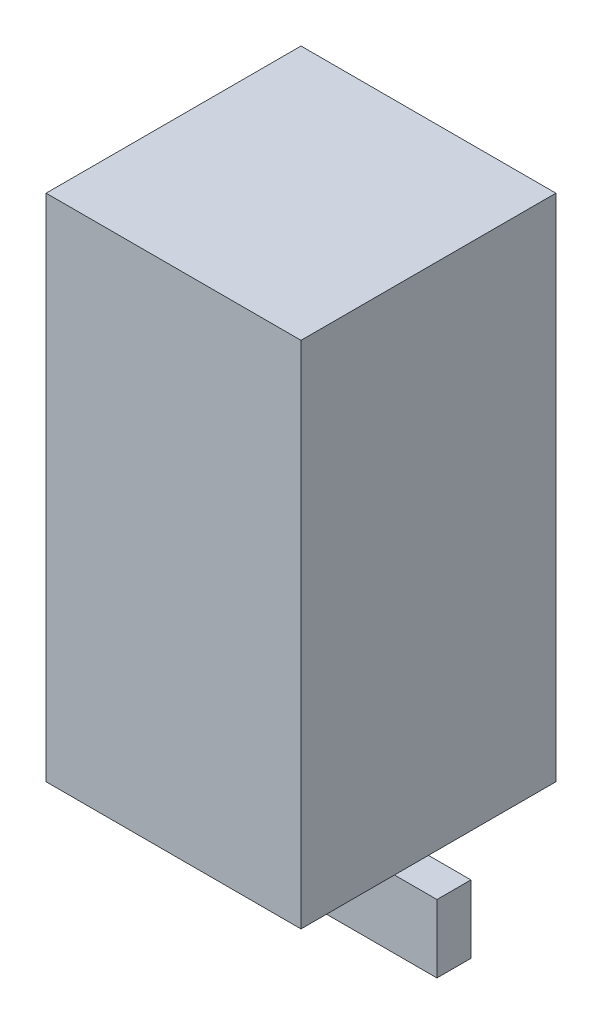
ISO-10303-21;
HEADER;
FILE_DESCRIPTION(('STEP AP214'),'2;1');
FILE_NAME('part.step','',(''),(''),'','','');
FILE_SCHEMA(('AUTOMOTIVE_DESIGN { 1 0 10303 214 1 1 1 1 }'));
ENDSEC;
DATA;
#1=APPLICATION_CONTEXT('core data for automotive mechanical design processes');
#2=APPLICATION_PROTOCOL_DEFINITION('international standard','automotive_design',2000,#1);
#3=PRODUCT_CONTEXT('',#1,'mechanical');
#4=PRODUCT('Part','Part','',(#3));
#5=PRODUCT_RELATED_PRODUCT_CATEGORY('part','',(#4));
#6=PRODUCT_DEFINITION_FORMATION('','',#4);
#7=PRODUCT_DEFINITION_CONTEXT('part definition',#1,'design');
#8=PRODUCT_DEFINITION('design','',#6,#7);
#9=PRODUCT_DEFINITION_SHAPE('','',#8);
#10=(LENGTH_UNIT() NAMED_UNIT(*) SI_UNIT(.MILLI.,.METRE.));
#11=(NAMED_UNIT(*) PLANE_ANGLE_UNIT() SI_UNIT($,.RADIAN.));
#12=(NAMED_UNIT(*) SI_UNIT($,.STERADIAN.) SOLID_ANGLE_UNIT());
#13=UNCERTAINTY_MEASURE_WITH_UNIT(LENGTH_MEASURE(1.E-05),#10,'distance_accuracy_value','');
#14=(GEOMETRIC_REPRESENTATION_CONTEXT(3) GLOBAL_UNCERTAINTY_ASSIGNED_CONTEXT((#13)) GLOBAL_UNIT_ASSIGNED_CONTEXT((#10,
#11,#12)) REPRESENTATION_CONTEXT('',''));
#15=CARTESIAN_POINT('',(0.,0.,0.));
#16=DIRECTION('',(0.,0.,1.));
#17=DIRECTION('',(1.,0.,0.));
#18=AXIS2_PLACEMENT_3D('',#15,#16,#17);
#19=CARTESIAN_POINT('',(0.,-2.,0.));
#20=DIRECTION('',(0.,-1.,0.));
#21=DIRECTION('',(0.,0.,-1.));
#22=AXIS2_PLACEMENT_3D('',#19,#20,#21);
#23=PLANE('',#22);
#24=CARTESIAN_POINT('',(0.,-2.,0.));
#25=DIRECTION('',(0.,-1.,0.));
#26=DIRECTION('',(0.,0.,-1.));
#27=AXIS2_PLACEMENT_3D('',#24,#25,#26);
#28=CIRCLE('',#27,5.);
#29=CARTESIAN_POINT('',(-4.58257569495584,-2.,-2.));
#30=VERTEX_POINT('',#29);
#31=CARTESIAN_POINT('',(4.58257569495584,-2.,-2.));
#32=VERTEX_POINT('',#31);
#33=EDGE_CURVE('E183',#30,#32,#28,.T.);
#34=ORIENTED_EDGE('',*,*,#33,.T.);
#35=DIRECTION('',(-1.,0.,0.));
#36=VECTOR('',#35,1.);
#37=CARTESIAN_POINT('',(-5.,-2.,-2.));
#38=LINE('',#37,#36);
#39=EDGE_CURVE('E49',#32,#30,#38,.T.);
#40=ORIENTED_EDGE('',*,*,#39,.T.);
#41=EDGE_LOOP('',(#34,#40));
#42=FACE_BOUND('',#41,.T.);
#43=ADVANCED_FACE('F39',(#42),#23,.T.);
#44=CARTESIAN_POINT('',(15.,60.,15.));
#45=DIRECTION('',(-1.,0.,0.));
#46=DIRECTION('',(0.,0.,1.));
#47=AXIS2_PLACEMENT_3D('',#44,#45,#46);
#48=PLANE('',#47);
#49=DIRECTION('',(0.,0.,-1.));
#50=VECTOR('',#49,1.);
#51=CARTESIAN_POINT('',(15.,0.,15.));
#52=LINE('',#51,#50);
#53=CARTESIAN_POINT('',(15.,0.,15.));
#54=VERTEX_POINT('',#53);
#55=CARTESIAN_POINT('',(15.,0.,-15.));
#56=VERTEX_POINT('',#55);
#57=EDGE_CURVE('E193',#54,#56,#52,.T.);
#58=ORIENTED_EDGE('',*,*,#57,.T.);
#59=DIRECTION('',(0.,-1.,0.));
#60=VECTOR('',#59,1.);
#61=CARTESIAN_POINT('',(15.,60.,-15.));
#62=LINE('',#61,#60);
#63=CARTESIAN_POINT('',(15.,60.,-15.));
#64=VERTEX_POINT('',#63);
#65=EDGE_CURVE('E43',#64,#56,#62,.T.);
#66=ORIENTED_EDGE('',*,*,#65,.F.);
#67=DIRECTION('',(0.,0.,-1.));
#68=VECTOR('',#67,1.);
#69=CARTESIAN_POINT('',(15.,60.,15.));
#70=LINE('',#69,#68);
#71=CARTESIAN_POINT('',(15.,60.,15.));
#72=VERTEX_POINT('',#71);
#73=EDGE_CURVE('E199',#72,#64,#70,.T.);
#74=ORIENTED_EDGE('',*,*,#73,.F.);
#75=DIRECTION('',(0.,-1.,0.));
#76=VECTOR('',#75,1.);
#77=CARTESIAN_POINT('',(15.,60.,15.));
#78=LINE('',#77,#76);
#79=EDGE_CURVE('E209',#72,#54,#78,.T.);
#80=ORIENTED_EDGE('',*,*,#79,.T.);
#81=EDGE_LOOP('',(#58,#66,#74,#80));
#82=FACE_BOUND('',#81,.T.);
#83=ADVANCED_FACE('F41',(#82),#48,.F.);
#84=CARTESIAN_POINT('',(-15.,60.,-15.));
#85=DIRECTION('',(0.,0.,1.));
#86=DIRECTION('',(1.,0.,0.));
#87=AXIS2_PLACEMENT_3D('',#84,#85,#86);
#88=PLANE('',#87);
#89=DIRECTION('',(-1.,0.,0.));
#90=VECTOR('',#89,1.);
#91=CARTESIAN_POINT('',(-15.,0.,-15.));
#92=LINE('',#91,#90);
#93=CARTESIAN_POINT('',(-15.,0.,-15.));
#94=VERTEX_POINT('',#93);
#95=EDGE_CURVE('E213',#56,#94,#92,.T.);
#96=ORIENTED_EDGE('',*,*,#95,.T.);
#97=DIRECTION('',(0.,-1.,0.));
#98=VECTOR('',#97,1.);
#99=CARTESIAN_POINT('',(-15.,60.,-15.));
#100=LINE('',#99,#98);
#101=CARTESIAN_POINT('',(-15.,60.,-15.));
#102=VERTEX_POINT('',#101);
#103=EDGE_CURVE('E225',#102,#94,#100,.T.);
#104=ORIENTED_EDGE('',*,*,#103,.F.);
#105=DIRECTION('',(-1.,0.,0.));
#106=VECTOR('',#105,1.);
#107=CARTESIAN_POINT('',(-15.,60.,-15.));
#108=LINE('',#107,#106);
#109=EDGE_CURVE('E97',#64,#102,#108,.T.);
#110=ORIENTED_EDGE('',*,*,#109,.F.);
#111=ORIENTED_EDGE('',*,*,#65,.T.);
#112=EDGE_LOOP('',(#96,#104,#110,#111));
#113=FACE_BOUND('',#112,.T.);
#114=ADVANCED_FACE('F233',(#113),#88,.F.);
#115=CARTESIAN_POINT('',(-15.,60.,15.));
#116=DIRECTION('',(1.,0.,0.));
#117=DIRECTION('',(0.,0.,-1.));
#118=AXIS2_PLACEMENT_3D('',#115,#116,#117);
#119=PLANE('',#118);
#120=DIRECTION('',(0.,0.,1.));
#121=VECTOR('',#120,1.);
#122=CARTESIAN_POINT('',(-15.,0.,15.));
#123=LINE('',#122,#121);
#124=CARTESIAN_POINT('',(-15.,0.,15.));
#125=VERTEX_POINT('',#124);
#126=EDGE_CURVE('E216',#94,#125,#123,.T.);
#127=ORIENTED_EDGE('',*,*,#126,.T.);
#128=DIRECTION('',(0.,-1.,0.));
#129=VECTOR('',#128,1.);
#130=CARTESIAN_POINT('',(-15.,60.,15.));
#131=LINE('',#130,#129);
#132=CARTESIAN_POINT('',(-15.,60.,15.));
#133=VERTEX_POINT('',#132);
#134=EDGE_CURVE('E223',#133,#125,#131,.T.);
#135=ORIENTED_EDGE('',*,*,#134,.F.);
#136=DIRECTION('',(0.,0.,1.));
#137=VECTOR('',#136,1.);
#138=CARTESIAN_POINT('',(-15.,60.,15.));
#139=LINE('',#138,#137);
#140=EDGE_CURVE('E204',#102,#133,#139,.T.);
#141=ORIENTED_EDGE('',*,*,#140,.F.);
#142=ORIENTED_EDGE('',*,*,#103,.T.);
#143=EDGE_LOOP('',(#127,#135,#141,#142));
#144=FACE_BOUND('',#143,.T.);
#145=ADVANCED_FACE('F240',(#144),#119,.F.);
#146=CARTESIAN_POINT('',(-15.,60.,15.));
#147=DIRECTION('',(0.,0.,-1.));
#148=DIRECTION('',(-1.,0.,0.));
#149=AXIS2_PLACEMENT_3D('',#146,#147,#148);
#150=PLANE('',#149);
#151=DIRECTION('',(1.,0.,0.));
#152=VECTOR('',#151,1.);
#153=CARTESIAN_POINT('',(-15.,0.,15.));
#154=LINE('',#153,#152);
#155=EDGE_CURVE('E89',#125,#54,#154,.T.);
#156=ORIENTED_EDGE('',*,*,#155,.T.);
#157=ORIENTED_EDGE('',*,*,#79,.F.);
#158=DIRECTION('',(1.,0.,0.));
#159=VECTOR('',#158,1.);
#160=CARTESIAN_POINT('',(-15.,60.,15.));
#161=LINE('',#160,#159);
#162=EDGE_CURVE('E68',#133,#72,#161,.T.);
#163=ORIENTED_EDGE('',*,*,#162,.F.);
#164=ORIENTED_EDGE('',*,*,#134,.T.);
#165=EDGE_LOOP('',(#156,#157,#163,#164));
#166=FACE_BOUND('',#165,.T.);
#167=ADVANCED_FACE('F241',(#166),#150,.F.);
#168=CARTESIAN_POINT('',(0.,60.,0.));
#169=DIRECTION('',(0.,-1.,0.));
#170=DIRECTION('',(0.,0.,-1.));
#171=AXIS2_PLACEMENT_3D('',#168,#169,#170);
#172=PLANE('',#171);
#173=ORIENTED_EDGE('',*,*,#73,.T.);
#174=ORIENTED_EDGE('',*,*,#109,.T.);
#175=ORIENTED_EDGE('',*,*,#140,.T.);
#176=ORIENTED_EDGE('',*,*,#162,.T.);
#177=EDGE_LOOP('',(#173,#174,#175,#176));
#178=FACE_BOUND('',#177,.T.);
#179=ADVANCED_FACE('F242',(#178),#172,.F.);
#180=CARTESIAN_POINT('',(0.,0.,0.));
#181=DIRECTION('',(0.,-1.,0.));
#182=DIRECTION('',(0.,0.,-1.));
#183=AXIS2_PLACEMENT_3D('',#180,#181,#182);
#184=PLANE('',#183);
#185=CARTESIAN_POINT('',(0.,0.,0.));
#186=DIRECTION('',(0.,-1.,0.));
#187=DIRECTION('',(0.,0.,-1.));
#188=AXIS2_PLACEMENT_3D('',#185,#186,#187);
#189=CIRCLE('',#188,5.);
#190=CARTESIAN_POINT('',(0.,0.,-5.));
#191=VERTEX_POINT('',#190);
#192=EDGE_CURVE('E195',#191,#191,#189,.T.);
#193=ORIENTED_EDGE('',*,*,#192,.F.);
#194=EDGE_LOOP('',(#193));
#195=FACE_BOUND('',#194,.T.);
#196=ORIENTED_EDGE('',*,*,#57,.F.);
#197=ORIENTED_EDGE('',*,*,#155,.F.);
#198=ORIENTED_EDGE('',*,*,#126,.F.);
#199=ORIENTED_EDGE('',*,*,#95,.F.);
#200=EDGE_LOOP('',(#196,#197,#198,#199));
#201=FACE_BOUND('',#200,.T.);
#202=ADVANCED_FACE('F238',(#195,#201),#184,.T.);
#203=CARTESIAN_POINT('',(0.,-2.,0.));
#204=DIRECTION('',(0.,1.,0.));
#205=DIRECTION('',(0.,0.,1.));
#206=AXIS2_PLACEMENT_3D('',#203,#204,#205);
#207=CYLINDRICAL_SURFACE('',#206,5.);
#208=CARTESIAN_POINT('',(4.58257569495584,-2.,2.));
#209=VERTEX_POINT('',#208);
#210=EDGE_CURVE('E190',#32,#209,#28,.T.);
#211=ORIENTED_EDGE('',*,*,#210,.F.);
#212=ORIENTED_EDGE('',*,*,#33,.F.);
#213=CARTESIAN_POINT('',(-5.,-2.,0.));
#214=VERTEX_POINT('',#213);
#215=EDGE_CURVE('E286',#214,#30,#28,.T.);
#216=ORIENTED_EDGE('',*,*,#215,.F.);
#217=CARTESIAN_POINT('',(-4.58257569495584,-2.,2.));
#218=VERTEX_POINT('',#217);
#219=EDGE_CURVE('E283',#218,#214,#28,.T.);
#220=ORIENTED_EDGE('',*,*,#219,.F.);
#221=EDGE_CURVE('E194',#209,#218,#28,.T.);
#222=ORIENTED_EDGE('',*,*,#221,.F.);
#223=EDGE_LOOP('',(#211,#212,#216,#220,#222));
#224=FACE_BOUND('',#223,.T.);
#225=ORIENTED_EDGE('',*,*,#192,.T.);
#226=EDGE_LOOP('',(#225));
#227=FACE_BOUND('',#226,.T.);
#228=ADVANCED_FACE('F249',(#224,#227),#207,.T.);
#229=DIRECTION('',(-1.,0.,0.));
#230=VECTOR('',#229,1.);
#231=CARTESIAN_POINT('',(-5.,-2.,2.));
#232=LINE('',#231,#230);
#233=EDGE_CURVE('E11',#209,#218,#232,.T.);
#234=ORIENTED_EDGE('',*,*,#233,.F.);
#235=ORIENTED_EDGE('',*,*,#221,.T.);
#236=EDGE_LOOP('',(#234,#235));
#237=FACE_BOUND('',#236,.T.);
#238=ADVANCED_FACE('F257',(#237),#23,.T.);
#239=CARTESIAN_POINT('',(-5.,-2.,-2.));
#240=DIRECTION('',(0.,1.,0.));
#241=DIRECTION('',(0.,0.,1.));
#242=AXIS2_PLACEMENT_3D('',#239,#240,#241);
#243=PLANE('',#242);
#244=CARTESIAN_POINT('',(18.,-2.,-2.));
#245=VERTEX_POINT('',#244);
#246=EDGE_CURVE('E147',#245,#32,#38,.T.);
#247=ORIENTED_EDGE('',*,*,#246,.T.);
#248=ORIENTED_EDGE('',*,*,#210,.T.);
#249=CARTESIAN_POINT('',(18.,-2.,2.));
#250=VERTEX_POINT('',#249);
#251=EDGE_CURVE('E51',#250,#209,#232,.T.);
#252=ORIENTED_EDGE('',*,*,#251,.F.);
#253=DIRECTION('',(0.,0.,1.));
#254=VECTOR('',#253,1.);
#255=CARTESIAN_POINT('',(18.,-2.,-2.));
#256=LINE('',#255,#254);
#257=EDGE_CURVE('E185',#245,#250,#256,.T.);
#258=ORIENTED_EDGE('',*,*,#257,.F.);
#259=EDGE_LOOP('',(#247,#248,#252,#258));
#260=FACE_BOUND('',#259,.T.);
#261=ADVANCED_FACE('F264',(#260),#243,.T.);
#262=CARTESIAN_POINT('',(-5.,-2.,2.));
#263=VERTEX_POINT('',#262);
#264=EDGE_CURVE('E52',#218,#263,#232,.T.);
#265=ORIENTED_EDGE('',*,*,#264,.F.);
#266=ORIENTED_EDGE('',*,*,#219,.T.);
#267=DIRECTION('',(0.,0.,1.));
#268=VECTOR('',#267,1.);
#269=CARTESIAN_POINT('',(-5.,-2.,-2.));
#270=LINE('',#269,#268);
#271=EDGE_CURVE('E184',#214,#263,#270,.T.);
#272=ORIENTED_EDGE('',*,*,#271,.T.);
#273=EDGE_LOOP('',(#265,#266,#272));
#274=FACE_BOUND('',#273,.T.);
#275=ADVANCED_FACE('F270',(#274),#243,.T.);
#276=CARTESIAN_POINT('',(0.601660305677737,-10.,-2.));
#277=DIRECTION('',(-0.819152044288989,-0.57357643635105,0.));
#278=DIRECTION('',(0.57357643635105,-0.819152044288989,0.));
#279=AXIS2_PLACEMENT_3D('',#276,#277,#278);
#280=PLANE('',#279);
#281=DIRECTION('',(0.,0.,1.));
#282=VECTOR('',#281,1.);
#283=CARTESIAN_POINT('',(0.601660305677737,-10.,-2.));
#284=LINE('',#283,#282);
#285=CARTESIAN_POINT('',(0.601660305677737,-10.,-2.));
#286=VERTEX_POINT('',#285);
#287=CARTESIAN_POINT('',(0.601660305677737,-10.,2.));
#288=VERTEX_POINT('',#287);
#289=EDGE_CURVE('E134',#286,#288,#284,.T.);
#290=ORIENTED_EDGE('',*,*,#289,.T.);
#291=DIRECTION('',(0.57357643635105,-0.819152044288989,0.));
#292=VECTOR('',#291,1.);
#293=CARTESIAN_POINT('',(0.601660305677737,-10.,2.));
#294=LINE('',#293,#292);
#295=EDGE_CURVE('E139',#263,#288,#294,.T.);
#296=ORIENTED_EDGE('',*,*,#295,.F.);
#297=ORIENTED_EDGE('',*,*,#271,.F.);
#298=CARTESIAN_POINT('',(-5.,-2.,-2.));
#299=VERTEX_POINT('',#298);
#300=EDGE_CURVE('E179',#299,#214,#270,.T.);
#301=ORIENTED_EDGE('',*,*,#300,.F.);
#302=DIRECTION('',(0.57357643635105,-0.819152044288989,0.));
#303=VECTOR('',#302,1.);
#304=CARTESIAN_POINT('',(0.601660305677737,-10.,-2.));
#305=LINE('',#304,#303);
#306=EDGE_CURVE('E141',#299,#286,#305,.T.);
#307=ORIENTED_EDGE('',*,*,#306,.T.);
#308=EDGE_LOOP('',(#290,#296,#297,#301,#307));
#309=FACE_BOUND('',#308,.T.);
#310=ADVANCED_FACE('F136',(#309),#280,.T.);
#311=ORIENTED_EDGE('',*,*,#300,.T.);
#312=ORIENTED_EDGE('',*,*,#215,.T.);
#313=EDGE_CURVE('E59',#30,#299,#38,.T.);
#314=ORIENTED_EDGE('',*,*,#313,.T.);
#315=EDGE_LOOP('',(#311,#312,#314));
#316=FACE_BOUND('',#315,.T.);
#317=ADVANCED_FACE('F273',(#316),#243,.T.);
#318=CARTESIAN_POINT('',(18.,-2.,-2.));
#319=DIRECTION('',(1.,0.,0.));
#320=DIRECTION('',(0.,0.,-1.));
#321=AXIS2_PLACEMENT_3D('',#318,#319,#320);
#322=PLANE('',#321);
#323=ORIENTED_EDGE('',*,*,#257,.T.);
#324=DIRECTION('',(0.,1.,0.));
#325=VECTOR('',#324,1.);
#326=CARTESIAN_POINT('',(18.,-2.,2.));
#327=LINE('',#326,#325);
#328=CARTESIAN_POINT('',(18.,-10.,2.));
#329=VERTEX_POINT('',#328);
#330=EDGE_CURVE('E156',#329,#250,#327,.T.);
#331=ORIENTED_EDGE('',*,*,#330,.F.);
#332=DIRECTION('',(0.,0.,1.));
#333=VECTOR('',#332,1.);
#334=CARTESIAN_POINT('',(18.,-10.,-2.));
#335=LINE('',#334,#333);
#336=CARTESIAN_POINT('',(18.,-10.,-2.));
#337=VERTEX_POINT('',#336);
#338=EDGE_CURVE('E146',#337,#329,#335,.T.);
#339=ORIENTED_EDGE('',*,*,#338,.F.);
#340=DIRECTION('',(0.,1.,0.));
#341=VECTOR('',#340,1.);
#342=CARTESIAN_POINT('',(18.,-2.,-2.));
#343=LINE('',#342,#341);
#344=EDGE_CURVE('E172',#337,#245,#343,.T.);
#345=ORIENTED_EDGE('',*,*,#344,.T.);
#346=EDGE_LOOP('',(#323,#331,#339,#345));
#347=FACE_BOUND('',#346,.T.);
#348=ADVANCED_FACE('F298',(#347),#322,.T.);
#349=CARTESIAN_POINT('',(18.,-10.,-2.));
#350=DIRECTION('',(0.,-1.,0.));
#351=DIRECTION('',(1.,0.,0.));
#352=AXIS2_PLACEMENT_3D('',#349,#350,#351);
#353=PLANE('',#352);
#354=ORIENTED_EDGE('',*,*,#338,.T.);
#355=DIRECTION('',(1.,0.,0.));
#356=VECTOR('',#355,1.);
#357=CARTESIAN_POINT('',(18.,-10.,2.));
#358=LINE('',#357,#356);
#359=EDGE_CURVE('E150',#288,#329,#358,.T.);
#360=ORIENTED_EDGE('',*,*,#359,.F.);
#361=ORIENTED_EDGE('',*,*,#289,.F.);
#362=DIRECTION('',(1.,0.,0.));
#363=VECTOR('',#362,1.);
#364=CARTESIAN_POINT('',(18.,-10.,-2.));
#365=LINE('',#364,#363);
#366=EDGE_CURVE('E169',#286,#337,#365,.T.);
#367=ORIENTED_EDGE('',*,*,#366,.T.);
#368=EDGE_LOOP('',(#354,#360,#361,#367));
#369=FACE_BOUND('',#368,.T.);
#370=ADVANCED_FACE('F151',(#369),#353,.T.);
#371=CARTESIAN_POINT('',(0.,0.,-2.));
#372=DIRECTION('',(0.,0.,-1.));
#373=DIRECTION('',(-1.,0.,0.));
#374=AXIS2_PLACEMENT_3D('',#371,#372,#373);
#375=PLANE('',#374);
#376=ORIENTED_EDGE('',*,*,#306,.F.);
#377=ORIENTED_EDGE('',*,*,#313,.F.);
#378=ORIENTED_EDGE('',*,*,#39,.F.);
#379=ORIENTED_EDGE('',*,*,#246,.F.);
#380=ORIENTED_EDGE('',*,*,#344,.F.);
#381=ORIENTED_EDGE('',*,*,#366,.F.);
#382=EDGE_LOOP('',(#376,#377,#378,#379,#380,#381));
#383=FACE_BOUND('',#382,.T.);
#384=ADVANCED_FACE('F295',(#383),#375,.T.);
#385=CARTESIAN_POINT('',(0.,0.,2.));
#386=DIRECTION('',(0.,0.,-1.));
#387=DIRECTION('',(-1.,0.,0.));
#388=AXIS2_PLACEMENT_3D('',#385,#386,#387);
#389=PLANE('',#388);
#390=ORIENTED_EDGE('',*,*,#295,.T.);
#391=ORIENTED_EDGE('',*,*,#359,.T.);
#392=ORIENTED_EDGE('',*,*,#330,.T.);
#393=ORIENTED_EDGE('',*,*,#251,.T.);
#394=ORIENTED_EDGE('',*,*,#233,.T.);
#395=ORIENTED_EDGE('',*,*,#264,.T.);
#396=EDGE_LOOP('',(#390,#391,#392,#393,#394,#395));
#397=FACE_BOUND('',#396,.T.);
#398=ADVANCED_FACE('F158',(#397),#389,.F.);
#399=CLOSED_SHELL('',(#43,#83,#114,#145,#167,#179,#202,#228,#238,#261,#275,#310,#317,#348,#370,
#384,#398));
#400=MANIFOLD_SOLID_BREP('B2',#399);
#401=ADVANCED_BREP_SHAPE_REPRESENTATION('',(#18,#400),#14);
#402=SHAPE_DEFINITION_REPRESENTATION(#9,#401);
ENDSEC;
END-ISO-10303-21;
